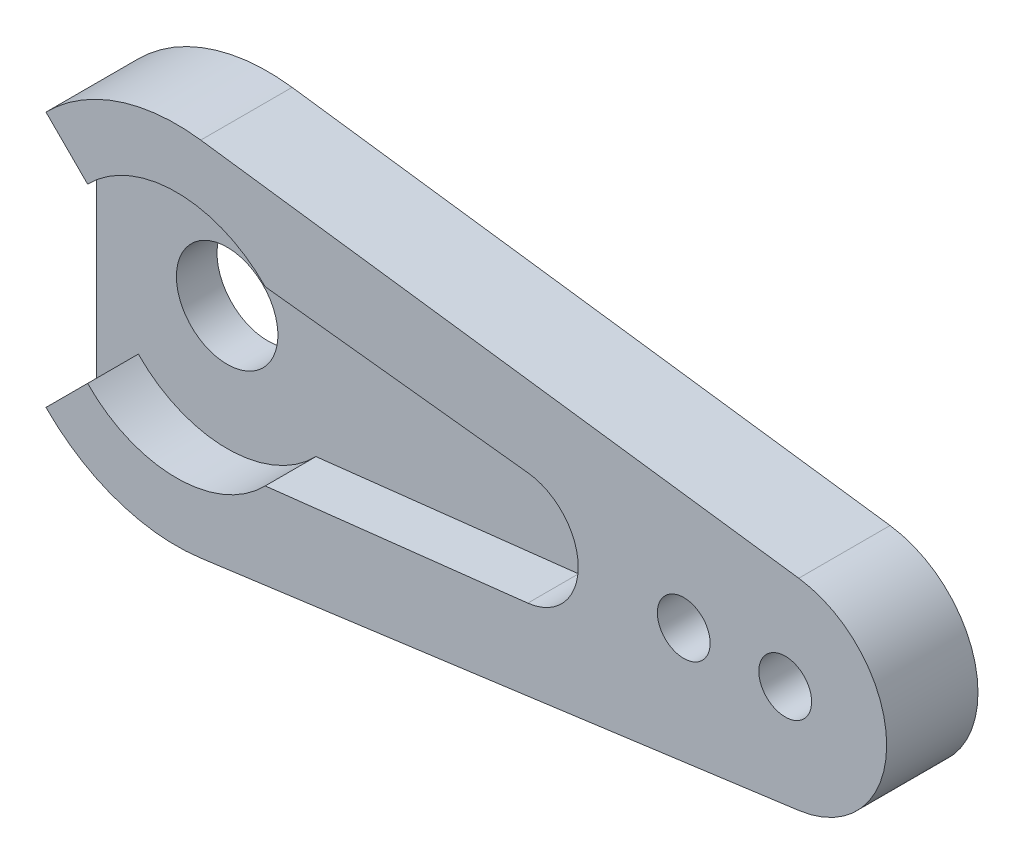
ISO-10303-21;
HEADER;
FILE_DESCRIPTION(('STEP AP214'),'2;1');
FILE_NAME('part.step','',(''),(''),'','','');
FILE_SCHEMA(('AUTOMOTIVE_DESIGN { 1 0 10303 214 1 1 1 1 }'));
ENDSEC;
DATA;
#1=APPLICATION_CONTEXT('core data for automotive mechanical design processes');
#2=APPLICATION_PROTOCOL_DEFINITION('international standard','automotive_design',2000,#1);
#3=PRODUCT_CONTEXT('',#1,'mechanical');
#4=PRODUCT('Part','Part','',(#3));
#5=PRODUCT_RELATED_PRODUCT_CATEGORY('part','',(#4));
#6=PRODUCT_DEFINITION_FORMATION('','',#4);
#7=PRODUCT_DEFINITION_CONTEXT('part definition',#1,'design');
#8=PRODUCT_DEFINITION('design','',#6,#7);
#9=PRODUCT_DEFINITION_SHAPE('','',#8);
#10=(LENGTH_UNIT() NAMED_UNIT(*) SI_UNIT(.MILLI.,.METRE.));
#11=(NAMED_UNIT(*) PLANE_ANGLE_UNIT() SI_UNIT($,.RADIAN.));
#12=(NAMED_UNIT(*) SI_UNIT($,.STERADIAN.) SOLID_ANGLE_UNIT());
#13=UNCERTAINTY_MEASURE_WITH_UNIT(LENGTH_MEASURE(1.E-05),#10,'distance_accuracy_value','');
#14=(GEOMETRIC_REPRESENTATION_CONTEXT(3) GLOBAL_UNCERTAINTY_ASSIGNED_CONTEXT((#13)) GLOBAL_UNIT_ASSIGNED_CONTEXT((#10,
#11,#12)) REPRESENTATION_CONTEXT('',''));
#15=CARTESIAN_POINT('',(0.,0.,0.));
#16=DIRECTION('',(0.,0.,1.));
#17=DIRECTION('',(1.,0.,0.));
#18=AXIS2_PLACEMENT_3D('',#15,#16,#17);
#19=CARTESIAN_POINT('',(0.,0.,2.5));
#20=DIRECTION('',(0.,0.,-1.));
#21=DIRECTION('',(-1.,0.,0.));
#22=AXIS2_PLACEMENT_3D('',#19,#20,#21);
#23=CYLINDRICAL_SURFACE('',#22,9.);
#24=DIRECTION('',(0.,0.,-1.));
#25=VECTOR('',#24,1.);
#26=CARTESIAN_POINT('',(1.2,8.9196412483911,2.5));
#27=LINE('',#26,#25);
#28=CARTESIAN_POINT('',(1.2,8.9196412483911,2.5));
#29=VERTEX_POINT('',#28);
#30=CARTESIAN_POINT('',(1.2,8.9196412483911,-2.));
#31=VERTEX_POINT('',#30);
#32=EDGE_CURVE('E185',#29,#31,#27,.T.);
#33=ORIENTED_EDGE('',*,*,#32,.T.);
#34=CARTESIAN_POINT('',(0.,0.,-2.));
#35=DIRECTION('',(0.,0.,-1.));
#36=DIRECTION('',(-1.,0.,0.));
#37=AXIS2_PLACEMENT_3D('',#34,#35,#36);
#38=CIRCLE('',#37,9.);
#39=CARTESIAN_POINT('',(-6.42654307097902,6.30075742723457,-2.));
#40=VERTEX_POINT('',#39);
#41=EDGE_CURVE('E135',#40,#31,#38,.T.);
#42=ORIENTED_EDGE('',*,*,#41,.F.);
#43=DIRECTION('',(0.,0.,1.));
#44=VECTOR('',#43,1.);
#45=CARTESIAN_POINT('',(-6.42654307097902,6.30075742723457,-2.));
#46=LINE('',#45,#44);
#47=CARTESIAN_POINT('',(-6.42654307097902,6.30075742723457,0.));
#48=VERTEX_POINT('',#47);
#49=EDGE_CURVE('E131',#40,#48,#46,.T.);
#50=ORIENTED_EDGE('',*,*,#49,.T.);
#51=DIRECTION('',(0.,0.,-1.));
#52=VECTOR('',#51,1.);
#53=CARTESIAN_POINT('',(-6.42654307097901,6.30075742723457,2.5));
#54=LINE('',#53,#52);
#55=CARTESIAN_POINT('',(-6.42654307097901,6.30075742723457,2.5));
#56=VERTEX_POINT('',#55);
#57=EDGE_CURVE('E11',#56,#48,#54,.T.);
#58=ORIENTED_EDGE('',*,*,#57,.F.);
#59=CARTESIAN_POINT('',(0.,0.,2.5));
#60=DIRECTION('',(0.,0.,1.));
#61=DIRECTION('',(-1.,0.,0.));
#62=AXIS2_PLACEMENT_3D('',#59,#60,#61);
#63=CIRCLE('',#62,9.);
#64=EDGE_CURVE('E162',#29,#56,#63,.T.);
#65=ORIENTED_EDGE('',*,*,#64,.F.);
#66=EDGE_LOOP('',(#33,#42,#50,#58,#65));
#67=FACE_BOUND('',#66,.T.);
#68=ADVANCED_FACE('F33',(#67),#23,.T.);
#69=CARTESIAN_POINT('',(-4.37578564374445,4.25,2.5));
#70=DIRECTION('',(0.707106781186548,0.707106781186548,0.));
#71=DIRECTION('',(-0.707106781186548,0.707106781186548,0.));
#72=AXIS2_PLACEMENT_3D('',#69,#70,#71);
#73=PLANE('',#72);
#74=DIRECTION('',(0.707106781186548,-0.707106781186548,0.));
#75=VECTOR('',#74,1.);
#76=CARTESIAN_POINT('',(-4.37578564374445,4.25,0.));
#77=LINE('',#76,#75);
#78=CARTESIAN_POINT('',(-4.37578564374445,4.25,0.));
#79=VERTEX_POINT('',#78);
#80=EDGE_CURVE('E154',#48,#79,#77,.T.);
#81=ORIENTED_EDGE('',*,*,#80,.T.);
#82=DIRECTION('',(0.,0.,-1.));
#83=VECTOR('',#82,1.);
#84=CARTESIAN_POINT('',(-4.37578564374445,4.25,2.5));
#85=LINE('',#84,#83);
#86=CARTESIAN_POINT('',(-4.37578564374445,4.25,2.5));
#87=VERTEX_POINT('',#86);
#88=EDGE_CURVE('E41',#87,#79,#85,.T.);
#89=ORIENTED_EDGE('',*,*,#88,.F.);
#90=DIRECTION('',(0.707106781186548,-0.707106781186548,0.));
#91=VECTOR('',#90,1.);
#92=CARTESIAN_POINT('',(-4.37578564374445,4.25,2.5));
#93=LINE('',#92,#91);
#94=EDGE_CURVE('E164',#56,#87,#93,.T.);
#95=ORIENTED_EDGE('',*,*,#94,.F.);
#96=ORIENTED_EDGE('',*,*,#57,.T.);
#97=EDGE_LOOP('',(#81,#89,#95,#96));
#98=FACE_BOUND('',#97,.T.);
#99=ADVANCED_FACE('F232',(#98),#73,.F.);
#100=CARTESIAN_POINT('',(0.,0.,2.5));
#101=DIRECTION('',(0.,0.,-1.));
#102=DIRECTION('',(-1.,0.,0.));
#103=AXIS2_PLACEMENT_3D('',#100,#101,#102);
#104=CYLINDRICAL_SURFACE('',#103,6.1);
#105=CARTESIAN_POINT('',(0.,0.,0.));
#106=DIRECTION('',(0.,0.,-1.));
#107=DIRECTION('',(1.,0.,0.));
#108=AXIS2_PLACEMENT_3D('',#105,#106,#107);
#109=CIRCLE('',#108,6.1);
#110=CARTESIAN_POINT('',(4.37578564374445,4.25,0.));
#111=VERTEX_POINT('',#110);
#112=EDGE_CURVE('E157',#79,#111,#109,.T.);
#113=ORIENTED_EDGE('',*,*,#112,.T.);
#114=DIRECTION('',(0.,0.,-1.));
#115=VECTOR('',#114,1.);
#116=CARTESIAN_POINT('',(4.37578564374445,4.25,2.5));
#117=LINE('',#116,#115);
#118=CARTESIAN_POINT('',(4.37578564374445,4.25,2.5));
#119=VERTEX_POINT('',#118);
#120=EDGE_CURVE('E222',#119,#111,#117,.T.);
#121=ORIENTED_EDGE('',*,*,#120,.F.);
#122=CARTESIAN_POINT('',(0.,0.,2.5));
#123=DIRECTION('',(0.,0.,-1.));
#124=DIRECTION('',(1.,0.,0.));
#125=AXIS2_PLACEMENT_3D('',#122,#123,#124);
#126=CIRCLE('',#125,6.1);
#127=EDGE_CURVE('E167',#87,#119,#126,.T.);
#128=ORIENTED_EDGE('',*,*,#127,.F.);
#129=ORIENTED_EDGE('',*,*,#88,.T.);
#130=EDGE_LOOP('',(#113,#121,#128,#129));
#131=FACE_BOUND('',#130,.T.);
#132=ADVANCED_FACE('F228',(#131),#104,.F.);
#133=CARTESIAN_POINT('',(4.37578564374445,4.25,2.5));
#134=DIRECTION('',(0.112713317991759,0.993627549913592,0.));
#135=DIRECTION('',(-0.993627549913592,0.112713317991759,0.));
#136=AXIS2_PLACEMENT_3D('',#133,#134,#135);
#137=PLANE('',#136);
#138=DIRECTION('',(0.993627549913592,-0.112713317991759,0.));
#139=VECTOR('',#138,1.);
#140=CARTESIAN_POINT('',(4.37578564374445,4.25,0.));
#141=LINE('',#140,#139);
#142=CARTESIAN_POINT('',(17.3155972903769,2.78215713975806,0.));
#143=VERTEX_POINT('',#142);
#144=EDGE_CURVE('E189',#111,#143,#141,.T.);
#145=ORIENTED_EDGE('',*,*,#144,.T.);
#146=DIRECTION('',(0.,0.,-1.));
#147=VECTOR('',#146,1.);
#148=CARTESIAN_POINT('',(17.3155972903769,2.78215713975806,2.5));
#149=LINE('',#148,#147);
#150=CARTESIAN_POINT('',(17.3155972903769,2.78215713975806,2.5));
#151=VERTEX_POINT('',#150);
#152=EDGE_CURVE('E219',#151,#143,#149,.T.);
#153=ORIENTED_EDGE('',*,*,#152,.F.);
#154=DIRECTION('',(0.993627549913592,-0.112713317991759,0.));
#155=VECTOR('',#154,1.);
#156=CARTESIAN_POINT('',(4.37578564374445,4.25,2.5));
#157=LINE('',#156,#155);
#158=EDGE_CURVE('E169',#119,#151,#157,.T.);
#159=ORIENTED_EDGE('',*,*,#158,.F.);
#160=ORIENTED_EDGE('',*,*,#120,.T.);
#161=EDGE_LOOP('',(#145,#153,#159,#160));
#162=FACE_BOUND('',#161,.T.);
#163=ADVANCED_FACE('F275',(#162),#137,.F.);
#164=CARTESIAN_POINT('',(17.,0.,2.5));
#165=DIRECTION('',(0.,0.,-1.));
#166=DIRECTION('',(-1.,0.,0.));
#167=AXIS2_PLACEMENT_3D('',#164,#165,#166);
#168=CYLINDRICAL_SURFACE('',#167,2.8);
#169=CARTESIAN_POINT('',(17.,0.,0.));
#170=DIRECTION('',(0.,0.,-1.));
#171=DIRECTION('',(1.,0.,0.));
#172=AXIS2_PLACEMENT_3D('',#169,#170,#171);
#173=CIRCLE('',#172,2.8);
#174=CARTESIAN_POINT('',(17.3155972903769,-2.78215713975806,0.));
#175=VERTEX_POINT('',#174);
#176=EDGE_CURVE('E192',#143,#175,#173,.T.);
#177=ORIENTED_EDGE('',*,*,#176,.T.);
#178=DIRECTION('',(0.,0.,-1.));
#179=VECTOR('',#178,1.);
#180=CARTESIAN_POINT('',(17.3155972903769,-2.78215713975806,2.5));
#181=LINE('',#180,#179);
#182=CARTESIAN_POINT('',(17.3155972903769,-2.78215713975806,2.5));
#183=VERTEX_POINT('',#182);
#184=EDGE_CURVE('E216',#183,#175,#181,.T.);
#185=ORIENTED_EDGE('',*,*,#184,.F.);
#186=CARTESIAN_POINT('',(17.,0.,2.5));
#187=DIRECTION('',(0.,0.,-1.));
#188=DIRECTION('',(1.,0.,0.));
#189=AXIS2_PLACEMENT_3D('',#186,#187,#188);
#190=CIRCLE('',#189,2.8);
#191=EDGE_CURVE('E171',#151,#183,#190,.T.);
#192=ORIENTED_EDGE('',*,*,#191,.F.);
#193=ORIENTED_EDGE('',*,*,#152,.T.);
#194=EDGE_LOOP('',(#177,#185,#192,#193));
#195=FACE_BOUND('',#194,.T.);
#196=ADVANCED_FACE('F270',(#195),#168,.F.);
#197=CARTESIAN_POINT('',(17.3155972903769,-2.78215713975806,2.5));
#198=DIRECTION('',(0.112713317991759,-0.993627549913592,0.));
#199=DIRECTION('',(0.993627549913592,0.112713317991759,0.));
#200=AXIS2_PLACEMENT_3D('',#197,#198,#199);
#201=PLANE('',#200);
#202=DIRECTION('',(-0.993627549913592,-0.112713317991759,0.));
#203=VECTOR('',#202,1.);
#204=CARTESIAN_POINT('',(17.3155972903769,-2.78215713975806,0.));
#205=LINE('',#204,#203);
#206=CARTESIAN_POINT('',(4.37578564374445,-4.25,0.));
#207=VERTEX_POINT('',#206);
#208=EDGE_CURVE('E195',#175,#207,#205,.T.);
#209=ORIENTED_EDGE('',*,*,#208,.T.);
#210=DIRECTION('',(0.,0.,-1.));
#211=VECTOR('',#210,1.);
#212=CARTESIAN_POINT('',(4.37578564374445,-4.25,2.5));
#213=LINE('',#212,#211);
#214=CARTESIAN_POINT('',(4.37578564374445,-4.25,2.5));
#215=VERTEX_POINT('',#214);
#216=EDGE_CURVE('E213',#215,#207,#213,.T.);
#217=ORIENTED_EDGE('',*,*,#216,.F.);
#218=DIRECTION('',(-0.993627549913592,-0.112713317991759,0.));
#219=VECTOR('',#218,1.);
#220=CARTESIAN_POINT('',(17.3155972903769,-2.78215713975806,2.5));
#221=LINE('',#220,#219);
#222=EDGE_CURVE('E173',#183,#215,#221,.T.);
#223=ORIENTED_EDGE('',*,*,#222,.F.);
#224=ORIENTED_EDGE('',*,*,#184,.T.);
#225=EDGE_LOOP('',(#209,#217,#223,#224));
#226=FACE_BOUND('',#225,.T.);
#227=ADVANCED_FACE('F267',(#226),#201,.F.);
#228=CARTESIAN_POINT('',(0.,0.,2.5));
#229=DIRECTION('',(0.,0.,-1.));
#230=DIRECTION('',(-1.,0.,0.));
#231=AXIS2_PLACEMENT_3D('',#228,#229,#230);
#232=CYLINDRICAL_SURFACE('',#231,6.1);
#233=CARTESIAN_POINT('',(0.,0.,0.));
#234=DIRECTION('',(0.,0.,-1.));
#235=DIRECTION('',(-1.,0.,0.));
#236=AXIS2_PLACEMENT_3D('',#233,#234,#235);
#237=CIRCLE('',#236,6.1);
#238=CARTESIAN_POINT('',(-4.37578564374444,-4.25,0.));
#239=VERTEX_POINT('',#238);
#240=EDGE_CURVE('E198',#207,#239,#237,.T.);
#241=ORIENTED_EDGE('',*,*,#240,.T.);
#242=DIRECTION('',(0.,0.,-1.));
#243=VECTOR('',#242,1.);
#244=CARTESIAN_POINT('',(-4.37578564374444,-4.25,2.5));
#245=LINE('',#244,#243);
#246=CARTESIAN_POINT('',(-4.37578564374444,-4.25,2.5));
#247=VERTEX_POINT('',#246);
#248=EDGE_CURVE('E210',#247,#239,#245,.T.);
#249=ORIENTED_EDGE('',*,*,#248,.F.);
#250=CARTESIAN_POINT('',(0.,0.,2.5));
#251=DIRECTION('',(0.,0.,-1.));
#252=DIRECTION('',(-1.,0.,0.));
#253=AXIS2_PLACEMENT_3D('',#250,#251,#252);
#254=CIRCLE('',#253,6.1);
#255=EDGE_CURVE('E175',#215,#247,#254,.T.);
#256=ORIENTED_EDGE('',*,*,#255,.F.);
#257=ORIENTED_EDGE('',*,*,#216,.T.);
#258=EDGE_LOOP('',(#241,#249,#256,#257));
#259=FACE_BOUND('',#258,.T.);
#260=ADVANCED_FACE('F263',(#259),#232,.F.);
#261=CARTESIAN_POINT('',(-4.37578564374445,-4.25,2.5));
#262=DIRECTION('',(0.707106781186548,-0.707106781186548,0.));
#263=DIRECTION('',(0.707106781186548,0.707106781186548,0.));
#264=AXIS2_PLACEMENT_3D('',#261,#262,#263);
#265=PLANE('',#264);
#266=DIRECTION('',(-0.707106781186548,-0.707106781186548,0.));
#267=VECTOR('',#266,1.);
#268=CARTESIAN_POINT('',(-4.37578564374445,-4.25,0.));
#269=LINE('',#268,#267);
#270=CARTESIAN_POINT('',(-6.42654307097901,-6.30075742723457,0.));
#271=VERTEX_POINT('',#270);
#272=EDGE_CURVE('E165',#239,#271,#269,.T.);
#273=ORIENTED_EDGE('',*,*,#272,.T.);
#274=DIRECTION('',(0.,0.,-1.));
#275=VECTOR('',#274,1.);
#276=CARTESIAN_POINT('',(-6.42654307097901,-6.30075742723457,2.5));
#277=LINE('',#276,#275);
#278=CARTESIAN_POINT('',(-6.42654307097901,-6.30075742723457,2.5));
#279=VERTEX_POINT('',#278);
#280=EDGE_CURVE('E153',#279,#271,#277,.T.);
#281=ORIENTED_EDGE('',*,*,#280,.F.);
#282=DIRECTION('',(-0.707106781186548,-0.707106781186548,0.));
#283=VECTOR('',#282,1.);
#284=CARTESIAN_POINT('',(-4.37578564374445,-4.25,2.5));
#285=LINE('',#284,#283);
#286=EDGE_CURVE('E177',#247,#279,#285,.T.);
#287=ORIENTED_EDGE('',*,*,#286,.F.);
#288=ORIENTED_EDGE('',*,*,#248,.T.);
#289=EDGE_LOOP('',(#273,#281,#287,#288));
#290=FACE_BOUND('',#289,.T.);
#291=ADVANCED_FACE('F261',(#290),#265,.F.);
#292=CARTESIAN_POINT('',(0.,0.,2.5));
#293=DIRECTION('',(0.,0.,-1.));
#294=DIRECTION('',(-1.,0.,0.));
#295=AXIS2_PLACEMENT_3D('',#292,#293,#294);
#296=CYLINDRICAL_SURFACE('',#295,9.);
#297=ORIENTED_EDGE('',*,*,#280,.T.);
#298=DIRECTION('',(0.,0.,1.));
#299=VECTOR('',#298,1.);
#300=CARTESIAN_POINT('',(-6.42654307097901,-6.30075742723457,-2.));
#301=LINE('',#300,#299);
#302=CARTESIAN_POINT('',(-6.42654307097901,-6.30075742723457,-2.));
#303=VERTEX_POINT('',#302);
#304=EDGE_CURVE('E128',#303,#271,#301,.T.);
#305=ORIENTED_EDGE('',*,*,#304,.F.);
#306=CARTESIAN_POINT('',(0.,0.,-2.));
#307=DIRECTION('',(0.,0.,-1.));
#308=DIRECTION('',(-1.,0.,0.));
#309=AXIS2_PLACEMENT_3D('',#306,#307,#308);
#310=CIRCLE('',#309,9.);
#311=CARTESIAN_POINT('',(1.2,-8.9196412483911,-2.));
#312=VERTEX_POINT('',#311);
#313=EDGE_CURVE('E136',#312,#303,#310,.T.);
#314=ORIENTED_EDGE('',*,*,#313,.F.);
#315=DIRECTION('',(0.,0.,-1.));
#316=VECTOR('',#315,1.);
#317=CARTESIAN_POINT('',(1.2,-8.9196412483911,2.5));
#318=LINE('',#317,#316);
#319=CARTESIAN_POINT('',(1.2,-8.9196412483911,2.5));
#320=VERTEX_POINT('',#319);
#321=EDGE_CURVE('E207',#320,#312,#318,.T.);
#322=ORIENTED_EDGE('',*,*,#321,.F.);
#323=CARTESIAN_POINT('',(0.,0.,2.5));
#324=DIRECTION('',(0.,0.,1.));
#325=DIRECTION('',(1.,0.,0.));
#326=AXIS2_PLACEMENT_3D('',#323,#324,#325);
#327=CIRCLE('',#326,9.);
#328=EDGE_CURVE('E179',#279,#320,#327,.T.);
#329=ORIENTED_EDGE('',*,*,#328,.F.);
#330=EDGE_LOOP('',(#297,#305,#314,#322,#329));
#331=FACE_BOUND('',#330,.T.);
#332=ADVANCED_FACE('F150',(#331),#296,.T.);
#333=CARTESIAN_POINT('',(1.2,-8.9196412483911,2.5));
#334=DIRECTION('',(-0.133333333333333,0.991071249821234,0.));
#335=DIRECTION('',(-0.991071249821234,-0.133333333333333,0.));
#336=AXIS2_PLACEMENT_3D('',#333,#334,#335);
#337=PLANE('',#336);
#338=ORIENTED_EDGE('',*,*,#321,.T.);
#339=DIRECTION('',(-0.991071249821234,-0.133333333333333,0.));
#340=VECTOR('',#339,1.);
#341=CARTESIAN_POINT('',(1.2,-8.9196412483911,-2.));
#342=LINE('',#341,#340);
#343=CARTESIAN_POINT('',(30.6666666666667,-4.95535624910617,-2.));
#344=VERTEX_POINT('',#343);
#345=EDGE_CURVE('E144',#344,#312,#342,.T.);
#346=ORIENTED_EDGE('',*,*,#345,.F.);
#347=DIRECTION('',(0.,0.,-1.));
#348=VECTOR('',#347,1.);
#349=CARTESIAN_POINT('',(30.6666666666667,-4.95535624910617,2.5));
#350=LINE('',#349,#348);
#351=CARTESIAN_POINT('',(30.6666666666667,-4.95535624910617,2.5));
#352=VERTEX_POINT('',#351);
#353=EDGE_CURVE('E205',#352,#344,#350,.T.);
#354=ORIENTED_EDGE('',*,*,#353,.F.);
#355=DIRECTION('',(0.991071249821234,0.133333333333333,0.));
#356=VECTOR('',#355,1.);
#357=CARTESIAN_POINT('',(1.2,-8.9196412483911,2.5));
#358=LINE('',#357,#356);
#359=EDGE_CURVE('E181',#320,#352,#358,.T.);
#360=ORIENTED_EDGE('',*,*,#359,.F.);
#361=EDGE_LOOP('',(#338,#346,#354,#360));
#362=FACE_BOUND('',#361,.T.);
#363=ADVANCED_FACE('F253',(#362),#337,.F.);
#364=CARTESIAN_POINT('',(30.,0.,2.5));
#365=DIRECTION('',(0.,0.,-1.));
#366=DIRECTION('',(-1.,0.,0.));
#367=AXIS2_PLACEMENT_3D('',#364,#365,#366);
#368=CYLINDRICAL_SURFACE('',#367,5.);
#369=ORIENTED_EDGE('',*,*,#353,.T.);
#370=CARTESIAN_POINT('',(30.,0.,-2.));
#371=DIRECTION('',(0.,0.,-1.));
#372=DIRECTION('',(-1.,0.,0.));
#373=AXIS2_PLACEMENT_3D('',#370,#371,#372);
#374=CIRCLE('',#373,5.);
#375=CARTESIAN_POINT('',(30.6666666666667,4.95535624910617,-2.));
#376=VERTEX_POINT('',#375);
#377=EDGE_CURVE('E244',#376,#344,#374,.T.);
#378=ORIENTED_EDGE('',*,*,#377,.F.);
#379=DIRECTION('',(0.,0.,-1.));
#380=VECTOR('',#379,1.);
#381=CARTESIAN_POINT('',(30.6666666666667,4.95535624910617,2.5));
#382=LINE('',#381,#380);
#383=CARTESIAN_POINT('',(30.6666666666667,4.95535624910617,2.5));
#384=VERTEX_POINT('',#383);
#385=EDGE_CURVE('E203',#384,#376,#382,.T.);
#386=ORIENTED_EDGE('',*,*,#385,.F.);
#387=CARTESIAN_POINT('',(30.,0.,2.5));
#388=DIRECTION('',(0.,0.,1.));
#389=DIRECTION('',(-1.,0.,0.));
#390=AXIS2_PLACEMENT_3D('',#387,#388,#389);
#391=CIRCLE('',#390,5.);
#392=EDGE_CURVE('E183',#352,#384,#391,.T.);
#393=ORIENTED_EDGE('',*,*,#392,.F.);
#394=EDGE_LOOP('',(#369,#378,#386,#393));
#395=FACE_BOUND('',#394,.T.);
#396=ADVANCED_FACE('F347',(#395),#368,.T.);
#397=CARTESIAN_POINT('',(1.2,8.9196412483911,2.5));
#398=DIRECTION('',(-0.133333333333333,-0.991071249821234,0.));
#399=DIRECTION('',(0.991071249821234,-0.133333333333333,0.));
#400=AXIS2_PLACEMENT_3D('',#397,#398,#399);
#401=PLANE('',#400);
#402=ORIENTED_EDGE('',*,*,#385,.T.);
#403=DIRECTION('',(0.991071249821234,-0.133333333333333,0.));
#404=VECTOR('',#403,1.);
#405=CARTESIAN_POINT('',(1.2,8.9196412483911,-2.));
#406=LINE('',#405,#404);
#407=EDGE_CURVE('E242',#31,#376,#406,.T.);
#408=ORIENTED_EDGE('',*,*,#407,.F.);
#409=ORIENTED_EDGE('',*,*,#32,.F.);
#410=DIRECTION('',(-0.991071249821234,0.133333333333333,0.));
#411=VECTOR('',#410,1.);
#412=CARTESIAN_POINT('',(1.2,8.9196412483911,2.5));
#413=LINE('',#412,#411);
#414=EDGE_CURVE('E48',#384,#29,#413,.T.);
#415=ORIENTED_EDGE('',*,*,#414,.F.);
#416=EDGE_LOOP('',(#402,#408,#409,#415));
#417=FACE_BOUND('',#416,.T.);
#418=ADVANCED_FACE('F357',(#417),#401,.F.);
#419=CARTESIAN_POINT('',(0.,0.,2.5));
#420=DIRECTION('',(0.,0.,-1.));
#421=DIRECTION('',(-1.,0.,0.));
#422=AXIS2_PLACEMENT_3D('',#419,#420,#421);
#423=PLANE('',#422);
#424=CARTESIAN_POINT('',(25.,0.,2.5));
#425=DIRECTION('',(0.,0.,1.));
#426=DIRECTION('',(1.,0.,0.));
#427=AXIS2_PLACEMENT_3D('',#424,#425,#426);
#428=CIRCLE('',#427,1.3);
#429=CARTESIAN_POINT('',(26.3,0.,2.5));
#430=VERTEX_POINT('',#429);
#431=EDGE_CURVE('E443',#430,#430,#428,.T.);
#432=ORIENTED_EDGE('',*,*,#431,.F.);
#433=EDGE_LOOP('',(#432));
#434=FACE_BOUND('',#433,.T.);
#435=CARTESIAN_POINT('',(30.,0.,2.5));
#436=DIRECTION('',(0.,0.,1.));
#437=DIRECTION('',(1.,0.,0.));
#438=AXIS2_PLACEMENT_3D('',#435,#436,#437);
#439=CIRCLE('',#438,1.3);
#440=CARTESIAN_POINT('',(31.3,0.,2.5));
#441=VERTEX_POINT('',#440);
#442=EDGE_CURVE('E445',#441,#441,#439,.T.);
#443=ORIENTED_EDGE('',*,*,#442,.F.);
#444=EDGE_LOOP('',(#443));
#445=FACE_BOUND('',#444,.T.);
#446=ORIENTED_EDGE('',*,*,#64,.T.);
#447=ORIENTED_EDGE('',*,*,#94,.T.);
#448=ORIENTED_EDGE('',*,*,#127,.T.);
#449=ORIENTED_EDGE('',*,*,#158,.T.);
#450=ORIENTED_EDGE('',*,*,#191,.T.);
#451=ORIENTED_EDGE('',*,*,#222,.T.);
#452=ORIENTED_EDGE('',*,*,#255,.T.);
#453=ORIENTED_EDGE('',*,*,#286,.T.);
#454=ORIENTED_EDGE('',*,*,#328,.T.);
#455=ORIENTED_EDGE('',*,*,#359,.T.);
#456=ORIENTED_EDGE('',*,*,#392,.T.);
#457=ORIENTED_EDGE('',*,*,#414,.T.);
#458=EDGE_LOOP('',(#446,#447,#448,#449,#450,#451,#452,#453,#454,#455,#456,#457));
#459=FACE_BOUND('',#458,.T.);
#460=ADVANCED_FACE('F256',(#434,#445,#459),#423,.F.);
#461=CARTESIAN_POINT('',(0.,0.,-2.));
#462=DIRECTION('',(0.,0.,-1.));
#463=DIRECTION('',(-1.,0.,0.));
#464=AXIS2_PLACEMENT_3D('',#461,#462,#463);
#465=PLANE('',#464);
#466=CARTESIAN_POINT('',(25.,0.,-2.));
#467=DIRECTION('',(0.,0.,1.));
#468=DIRECTION('',(1.,0.,0.));
#469=AXIS2_PLACEMENT_3D('',#466,#467,#468);
#470=CIRCLE('',#469,1.3);
#471=CARTESIAN_POINT('',(26.3,0.,-2.));
#472=VERTEX_POINT('',#471);
#473=EDGE_CURVE('E440',#472,#472,#470,.T.);
#474=ORIENTED_EDGE('',*,*,#473,.T.);
#475=EDGE_LOOP('',(#474));
#476=FACE_BOUND('',#475,.T.);
#477=CARTESIAN_POINT('',(30.,0.,-2.));
#478=DIRECTION('',(0.,0.,1.));
#479=DIRECTION('',(1.,0.,0.));
#480=AXIS2_PLACEMENT_3D('',#477,#478,#479);
#481=CIRCLE('',#480,1.3);
#482=CARTESIAN_POINT('',(31.3,0.,-2.));
#483=VERTEX_POINT('',#482);
#484=EDGE_CURVE('E448',#483,#483,#481,.T.);
#485=ORIENTED_EDGE('',*,*,#484,.T.);
#486=EDGE_LOOP('',(#485));
#487=FACE_BOUND('',#486,.T.);
#488=ORIENTED_EDGE('',*,*,#313,.T.);
#489=DIRECTION('',(0.,1.,0.));
#490=VECTOR('',#489,1.);
#491=CARTESIAN_POINT('',(-6.42654307097901,-6.30075742723457,-2.));
#492=LINE('',#491,#490);
#493=EDGE_CURVE('E123',#303,#40,#492,.T.);
#494=ORIENTED_EDGE('',*,*,#493,.T.);
#495=ORIENTED_EDGE('',*,*,#41,.T.);
#496=ORIENTED_EDGE('',*,*,#407,.T.);
#497=ORIENTED_EDGE('',*,*,#377,.T.);
#498=ORIENTED_EDGE('',*,*,#345,.T.);
#499=EDGE_LOOP('',(#488,#494,#495,#496,#497,#498));
#500=FACE_BOUND('',#499,.T.);
#501=CARTESIAN_POINT('',(0.,0.,-2.));
#502=DIRECTION('',(0.,0.,-1.));
#503=DIRECTION('',(-1.,0.,0.));
#504=AXIS2_PLACEMENT_3D('',#501,#502,#503);
#505=CIRCLE('',#504,2.5);
#506=CARTESIAN_POINT('',(-2.5,0.,-2.));
#507=VERTEX_POINT('',#506);
#508=EDGE_CURVE('E237',#507,#507,#505,.T.);
#509=ORIENTED_EDGE('',*,*,#508,.F.);
#510=EDGE_LOOP('',(#509));
#511=FACE_BOUND('',#510,.T.);
#512=ADVANCED_FACE('F140',(#476,#487,#500,#511),#465,.T.);
#513=CARTESIAN_POINT('',(0.,0.,0.));
#514=DIRECTION('',(0.,0.,-1.));
#515=DIRECTION('',(-1.,0.,0.));
#516=AXIS2_PLACEMENT_3D('',#513,#514,#515);
#517=PLANE('',#516);
#518=ORIENTED_EDGE('',*,*,#272,.F.);
#519=ORIENTED_EDGE('',*,*,#240,.F.);
#520=ORIENTED_EDGE('',*,*,#208,.F.);
#521=ORIENTED_EDGE('',*,*,#176,.F.);
#522=ORIENTED_EDGE('',*,*,#144,.F.);
#523=ORIENTED_EDGE('',*,*,#112,.F.);
#524=ORIENTED_EDGE('',*,*,#80,.F.);
#525=DIRECTION('',(0.,1.,0.));
#526=VECTOR('',#525,1.);
#527=CARTESIAN_POINT('',(-6.42654307097901,-6.30075742723457,0.));
#528=LINE('',#527,#526);
#529=EDGE_CURVE('E147',#271,#48,#528,.T.);
#530=ORIENTED_EDGE('',*,*,#529,.F.);
#531=EDGE_LOOP('',(#518,#519,#520,#521,#522,#523,#524,#530));
#532=FACE_BOUND('',#531,.T.);
#533=CARTESIAN_POINT('',(0.,0.,0.));
#534=DIRECTION('',(0.,0.,-1.));
#535=DIRECTION('',(-1.,0.,0.));
#536=AXIS2_PLACEMENT_3D('',#533,#534,#535);
#537=CIRCLE('',#536,2.5);
#538=CARTESIAN_POINT('',(-2.5,0.,0.));
#539=VERTEX_POINT('',#538);
#540=EDGE_CURVE('E451',#539,#539,#537,.T.);
#541=ORIENTED_EDGE('',*,*,#540,.T.);
#542=EDGE_LOOP('',(#541));
#543=FACE_BOUND('',#542,.T.);
#544=ADVANCED_FACE('F235',(#532,#543),#517,.F.);
#545=CARTESIAN_POINT('',(-6.42654307097901,-6.30075742723457,-2.));
#546=DIRECTION('',(1.,0.,0.));
#547=DIRECTION('',(0.,0.,-1.));
#548=AXIS2_PLACEMENT_3D('',#545,#546,#547);
#549=PLANE('',#548);
#550=ORIENTED_EDGE('',*,*,#529,.T.);
#551=ORIENTED_EDGE('',*,*,#49,.F.);
#552=ORIENTED_EDGE('',*,*,#493,.F.);
#553=ORIENTED_EDGE('',*,*,#304,.T.);
#554=EDGE_LOOP('',(#550,#551,#552,#553));
#555=FACE_BOUND('',#554,.T.);
#556=ADVANCED_FACE('F126',(#555),#549,.F.);
#557=CARTESIAN_POINT('',(0.,0.,-2.));
#558=DIRECTION('',(0.,0.,1.));
#559=DIRECTION('',(1.,0.,0.));
#560=AXIS2_PLACEMENT_3D('',#557,#558,#559);
#561=CYLINDRICAL_SURFACE('',#560,2.5);
#562=ORIENTED_EDGE('',*,*,#508,.T.);
#563=EDGE_LOOP('',(#562));
#564=FACE_BOUND('',#563,.T.);
#565=ORIENTED_EDGE('',*,*,#540,.F.);
#566=EDGE_LOOP('',(#565));
#567=FACE_BOUND('',#566,.T.);
#568=ADVANCED_FACE('F388',(#564,#567),#561,.F.);
#569=CARTESIAN_POINT('',(30.,0.,-2.));
#570=DIRECTION('',(0.,0.,1.));
#571=DIRECTION('',(1.,0.,0.));
#572=AXIS2_PLACEMENT_3D('',#569,#570,#571);
#573=CYLINDRICAL_SURFACE('',#572,1.3);
#574=ORIENTED_EDGE('',*,*,#484,.F.);
#575=EDGE_LOOP('',(#574));
#576=FACE_BOUND('',#575,.T.);
#577=ORIENTED_EDGE('',*,*,#442,.T.);
#578=EDGE_LOOP('',(#577));
#579=FACE_BOUND('',#578,.T.);
#580=ADVANCED_FACE('F397',(#576,#579),#573,.F.);
#581=CARTESIAN_POINT('',(25.,0.,-2.));
#582=DIRECTION('',(0.,0.,1.));
#583=DIRECTION('',(1.,0.,0.));
#584=AXIS2_PLACEMENT_3D('',#581,#582,#583);
#585=CYLINDRICAL_SURFACE('',#584,1.3);
#586=ORIENTED_EDGE('',*,*,#473,.F.);
#587=EDGE_LOOP('',(#586));
#588=FACE_BOUND('',#587,.T.);
#589=ORIENTED_EDGE('',*,*,#431,.T.);
#590=EDGE_LOOP('',(#589));
#591=FACE_BOUND('',#590,.T.);
#592=ADVANCED_FACE('F423',(#588,#591),#585,.F.);
#593=CLOSED_SHELL('',(#68,#99,#132,#163,#196,#227,#260,#291,#332,#363,#396,#418,#460,#512,#544,
#556,#568,#580,#592));
#594=MANIFOLD_SOLID_BREP('B2',#593);
#595=ADVANCED_BREP_SHAPE_REPRESENTATION('',(#18,#594),#14);
#596=SHAPE_DEFINITION_REPRESENTATION(#9,#595);
ENDSEC;
END-ISO-10303-21;
